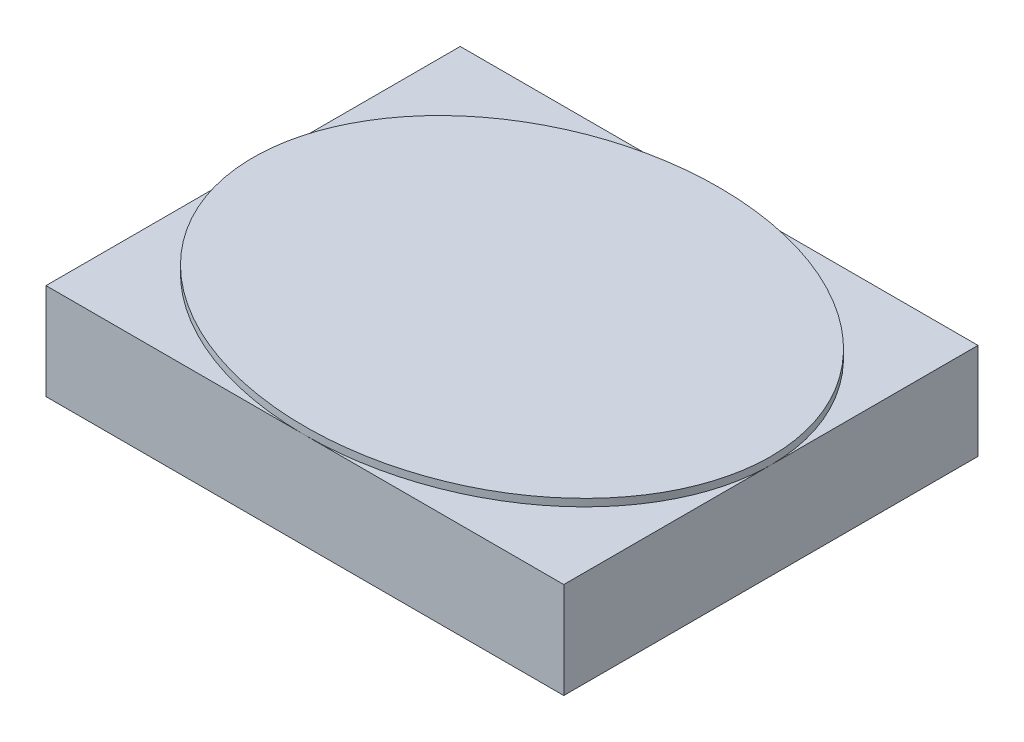
ISO-10303-21;
HEADER;
FILE_DESCRIPTION(('STEP AP214'),'2;1');
FILE_NAME('part.step','',(''),(''),'','','');
FILE_SCHEMA(('AUTOMOTIVE_DESIGN { 1 0 10303 214 1 1 1 1 }'));
ENDSEC;
DATA;
#1=APPLICATION_CONTEXT('core data for automotive mechanical design processes');
#2=APPLICATION_PROTOCOL_DEFINITION('international standard','automotive_design',2000,#1);
#3=PRODUCT_CONTEXT('',#1,'mechanical');
#4=PRODUCT('Part','Part','',(#3));
#5=PRODUCT_RELATED_PRODUCT_CATEGORY('part','',(#4));
#6=PRODUCT_DEFINITION_FORMATION('','',#4);
#7=PRODUCT_DEFINITION_CONTEXT('part definition',#1,'design');
#8=PRODUCT_DEFINITION('design','',#6,#7);
#9=PRODUCT_DEFINITION_SHAPE('','',#8);
#10=(LENGTH_UNIT() NAMED_UNIT(*) SI_UNIT(.MILLI.,.METRE.));
#11=(NAMED_UNIT(*) PLANE_ANGLE_UNIT() SI_UNIT($,.RADIAN.));
#12=(NAMED_UNIT(*) SI_UNIT($,.STERADIAN.) SOLID_ANGLE_UNIT());
#13=UNCERTAINTY_MEASURE_WITH_UNIT(LENGTH_MEASURE(1.E-05),#10,'distance_accuracy_value','');
#14=(GEOMETRIC_REPRESENTATION_CONTEXT(3) GLOBAL_UNCERTAINTY_ASSIGNED_CONTEXT((#13)) GLOBAL_UNIT_ASSIGNED_CONTEXT((#10,
#11,#12)) REPRESENTATION_CONTEXT('',''));
#15=CARTESIAN_POINT('',(0.,0.,0.));
#16=DIRECTION('',(0.,0.,1.));
#17=DIRECTION('',(1.,0.,0.));
#18=AXIS2_PLACEMENT_3D('',#15,#16,#17);
#19=CARTESIAN_POINT('',(0.,0.65,0.));
#20=DIRECTION('',(0.,-1.,0.));
#21=DIRECTION('',(0.,0.,-1.));
#22=AXIS2_PLACEMENT_3D('',#19,#20,#21);
#23=PLANE('',#22);
#24=CARTESIAN_POINT('',(1.75,0.65,-1.4));
#25=DIRECTION('',(0.,1.,0.));
#26=DIRECTION('',(1.,0.,0.));
#27=AXIS2_PLACEMENT_3D('',#24,#25,#26);
#28=ELLIPSE('',#27,1.75,1.4);
#29=CARTESIAN_POINT('',(3.5,0.65,-1.4));
#30=VERTEX_POINT('',#29);
#31=CARTESIAN_POINT('',(1.75,0.65,-2.8));
#32=VERTEX_POINT('',#31);
#33=EDGE_CURVE('E43',#30,#32,#28,.T.);
#34=ORIENTED_EDGE('',*,*,#33,.F.);
#35=DIRECTION('',(0.,0.,-1.));
#36=VECTOR('',#35,1.);
#37=CARTESIAN_POINT('',(3.5,0.65,0.));
#38=LINE('',#37,#36);
#39=CARTESIAN_POINT('',(3.5,0.65,-2.8));
#40=VERTEX_POINT('',#39);
#41=EDGE_CURVE('E93',#30,#40,#38,.T.);
#42=ORIENTED_EDGE('',*,*,#41,.T.);
#43=DIRECTION('',(-1.,0.,0.));
#44=VECTOR('',#43,1.);
#45=CARTESIAN_POINT('',(0.,0.65,-2.8));
#46=LINE('',#45,#44);
#47=EDGE_CURVE('E105',#40,#32,#46,.T.);
#48=ORIENTED_EDGE('',*,*,#47,.T.);
#49=EDGE_LOOP('',(#34,#42,#48));
#50=FACE_BOUND('',#49,.T.);
#51=ADVANCED_FACE('F32',(#50),#23,.F.);
#52=CARTESIAN_POINT('',(0.,0.65,-1.4));
#53=VERTEX_POINT('',#52);
#54=EDGE_CURVE('E11',#32,#53,#28,.T.);
#55=ORIENTED_EDGE('',*,*,#54,.F.);
#56=CARTESIAN_POINT('',(0.,0.65,-2.8));
#57=VERTEX_POINT('',#56);
#58=EDGE_CURVE('E92',#32,#57,#46,.T.);
#59=ORIENTED_EDGE('',*,*,#58,.T.);
#60=DIRECTION('',(0.,0.,1.));
#61=VECTOR('',#60,1.);
#62=CARTESIAN_POINT('',(0.,0.65,0.));
#63=LINE('',#62,#61);
#64=EDGE_CURVE('E115',#57,#53,#63,.T.);
#65=ORIENTED_EDGE('',*,*,#64,.T.);
#66=EDGE_LOOP('',(#55,#59,#65));
#67=FACE_BOUND('',#66,.T.);
#68=ADVANCED_FACE('F146',(#67),#23,.F.);
#69=CARTESIAN_POINT('',(1.75,0.65,0.));
#70=VERTEX_POINT('',#69);
#71=EDGE_CURVE('E41',#53,#70,#28,.T.);
#72=ORIENTED_EDGE('',*,*,#71,.F.);
#73=CARTESIAN_POINT('',(0.,0.65,0.));
#74=VERTEX_POINT('',#73);
#75=EDGE_CURVE('E117',#53,#74,#63,.T.);
#76=ORIENTED_EDGE('',*,*,#75,.T.);
#77=DIRECTION('',(1.,0.,0.));
#78=VECTOR('',#77,1.);
#79=CARTESIAN_POINT('',(0.,0.65,0.));
#80=LINE('',#79,#78);
#81=EDGE_CURVE('E103',#74,#70,#80,.T.);
#82=ORIENTED_EDGE('',*,*,#81,.T.);
#83=EDGE_LOOP('',(#72,#76,#82));
#84=FACE_BOUND('',#83,.T.);
#85=ADVANCED_FACE('F148',(#84),#23,.F.);
#86=CARTESIAN_POINT('',(0.,0.65,0.));
#87=DIRECTION('',(1.,0.,0.));
#88=DIRECTION('',(0.,0.,-1.));
#89=AXIS2_PLACEMENT_3D('',#86,#87,#88);
#90=PLANE('',#89);
#91=DIRECTION('',(0.,0.,1.));
#92=VECTOR('',#91,1.);
#93=CARTESIAN_POINT('',(0.,0.,0.));
#94=LINE('',#93,#92);
#95=CARTESIAN_POINT('',(0.,0.,-2.8));
#96=VERTEX_POINT('',#95);
#97=CARTESIAN_POINT('',(0.,0.,0.));
#98=VERTEX_POINT('',#97);
#99=EDGE_CURVE('E122',#96,#98,#94,.T.);
#100=ORIENTED_EDGE('',*,*,#99,.T.);
#101=DIRECTION('',(0.,-1.,0.));
#102=VECTOR('',#101,1.);
#103=CARTESIAN_POINT('',(0.,0.65,0.));
#104=LINE('',#103,#102);
#105=EDGE_CURVE('E36',#74,#98,#104,.T.);
#106=ORIENTED_EDGE('',*,*,#105,.F.);
#107=ORIENTED_EDGE('',*,*,#75,.F.);
#108=ORIENTED_EDGE('',*,*,#64,.F.);
#109=DIRECTION('',(0.,-1.,0.));
#110=VECTOR('',#109,1.);
#111=CARTESIAN_POINT('',(0.,0.65,-2.8));
#112=LINE('',#111,#110);
#113=EDGE_CURVE('E121',#57,#96,#112,.T.);
#114=ORIENTED_EDGE('',*,*,#113,.T.);
#115=EDGE_LOOP('',(#100,#106,#107,#108,#114));
#116=FACE_BOUND('',#115,.T.);
#117=ADVANCED_FACE('F34',(#116),#90,.F.);
#118=CARTESIAN_POINT('',(0.,0.65,0.));
#119=DIRECTION('',(0.,0.,-1.));
#120=DIRECTION('',(-1.,0.,0.));
#121=AXIS2_PLACEMENT_3D('',#118,#119,#120);
#122=PLANE('',#121);
#123=DIRECTION('',(1.,0.,0.));
#124=VECTOR('',#123,1.);
#125=CARTESIAN_POINT('',(0.,0.,0.));
#126=LINE('',#125,#124);
#127=CARTESIAN_POINT('',(3.5,0.,0.));
#128=VERTEX_POINT('',#127);
#129=EDGE_CURVE('E125',#98,#128,#126,.T.);
#130=ORIENTED_EDGE('',*,*,#129,.T.);
#131=DIRECTION('',(0.,-1.,0.));
#132=VECTOR('',#131,1.);
#133=CARTESIAN_POINT('',(3.5,0.65,0.));
#134=LINE('',#133,#132);
#135=CARTESIAN_POINT('',(3.5,0.65,0.));
#136=VERTEX_POINT('',#135);
#137=EDGE_CURVE('E111',#136,#128,#134,.T.);
#138=ORIENTED_EDGE('',*,*,#137,.F.);
#139=EDGE_CURVE('E88',#70,#136,#80,.T.);
#140=ORIENTED_EDGE('',*,*,#139,.F.);
#141=ORIENTED_EDGE('',*,*,#81,.F.);
#142=ORIENTED_EDGE('',*,*,#105,.T.);
#143=EDGE_LOOP('',(#130,#138,#140,#141,#142));
#144=FACE_BOUND('',#143,.T.);
#145=ADVANCED_FACE('F164',(#144),#122,.F.);
#146=CARTESIAN_POINT('',(3.5,0.65,0.));
#147=DIRECTION('',(-1.,0.,0.));
#148=DIRECTION('',(0.,0.,1.));
#149=AXIS2_PLACEMENT_3D('',#146,#147,#148);
#150=PLANE('',#149);
#151=DIRECTION('',(0.,0.,-1.));
#152=VECTOR('',#151,1.);
#153=CARTESIAN_POINT('',(3.5,0.,0.));
#154=LINE('',#153,#152);
#155=CARTESIAN_POINT('',(3.5,0.,-2.8));
#156=VERTEX_POINT('',#155);
#157=EDGE_CURVE('E127',#128,#156,#154,.T.);
#158=ORIENTED_EDGE('',*,*,#157,.T.);
#159=DIRECTION('',(0.,-1.,0.));
#160=VECTOR('',#159,1.);
#161=CARTESIAN_POINT('',(3.5,0.65,-2.8));
#162=LINE('',#161,#160);
#163=EDGE_CURVE('E99',#40,#156,#162,.T.);
#164=ORIENTED_EDGE('',*,*,#163,.F.);
#165=ORIENTED_EDGE('',*,*,#41,.F.);
#166=EDGE_CURVE('E85',#136,#30,#38,.T.);
#167=ORIENTED_EDGE('',*,*,#166,.F.);
#168=ORIENTED_EDGE('',*,*,#137,.T.);
#169=EDGE_LOOP('',(#158,#164,#165,#167,#168));
#170=FACE_BOUND('',#169,.T.);
#171=ADVANCED_FACE('F97',(#170),#150,.F.);
#172=CARTESIAN_POINT('',(0.,0.65,-2.8));
#173=DIRECTION('',(0.,0.,1.));
#174=DIRECTION('',(1.,0.,0.));
#175=AXIS2_PLACEMENT_3D('',#172,#173,#174);
#176=PLANE('',#175);
#177=DIRECTION('',(-1.,0.,0.));
#178=VECTOR('',#177,1.);
#179=CARTESIAN_POINT('',(0.,0.,-2.8));
#180=LINE('',#179,#178);
#181=EDGE_CURVE('E129',#156,#96,#180,.T.);
#182=ORIENTED_EDGE('',*,*,#181,.T.);
#183=ORIENTED_EDGE('',*,*,#113,.F.);
#184=ORIENTED_EDGE('',*,*,#58,.F.);
#185=ORIENTED_EDGE('',*,*,#47,.F.);
#186=ORIENTED_EDGE('',*,*,#163,.T.);
#187=EDGE_LOOP('',(#182,#183,#184,#185,#186));
#188=FACE_BOUND('',#187,.T.);
#189=ADVANCED_FACE('F141',(#188),#176,.F.);
#190=EDGE_CURVE('E56',#70,#30,#28,.T.);
#191=ORIENTED_EDGE('',*,*,#190,.F.);
#192=ORIENTED_EDGE('',*,*,#139,.T.);
#193=ORIENTED_EDGE('',*,*,#166,.T.);
#194=EDGE_LOOP('',(#191,#192,#193));
#195=FACE_BOUND('',#194,.T.);
#196=ADVANCED_FACE('F87',(#195),#23,.F.);
#197=CARTESIAN_POINT('',(0.,0.,0.));
#198=DIRECTION('',(0.,-1.,0.));
#199=DIRECTION('',(0.,0.,-1.));
#200=AXIS2_PLACEMENT_3D('',#197,#198,#199);
#201=PLANE('',#200);
#202=ORIENTED_EDGE('',*,*,#99,.F.);
#203=ORIENTED_EDGE('',*,*,#181,.F.);
#204=ORIENTED_EDGE('',*,*,#157,.F.);
#205=ORIENTED_EDGE('',*,*,#129,.F.);
#206=EDGE_LOOP('',(#202,#203,#204,#205));
#207=FACE_BOUND('',#206,.T.);
#208=ADVANCED_FACE('F138',(#207),#201,.T.);
#209=CARTESIAN_POINT('',(1.75,0.7,-1.4));
#210=DIRECTION('',(0.,1.,0.));
#211=DIRECTION('',(1.,0.,0.));
#212=AXIS2_PLACEMENT_3D('',#209,#210,#211);
#213=ELLIPSE('',#212,1.75,1.4);
#214=DIRECTION('',(0.,-1.,0.));
#215=VECTOR('',#214,1.);
#216=SURFACE_OF_LINEAR_EXTRUSION('',#213,#215);
#217=CARTESIAN_POINT('',(3.5,0.7,-1.4));
#218=VERTEX_POINT('',#217);
#219=EDGE_CURVE('E107',#218,#218,#213,.T.);
#220=ORIENTED_EDGE('',*,*,#219,.F.);
#221=EDGE_LOOP('',(#220));
#222=FACE_BOUND('',#221,.T.);
#223=ORIENTED_EDGE('',*,*,#33,.T.);
#224=ORIENTED_EDGE('',*,*,#54,.T.);
#225=ORIENTED_EDGE('',*,*,#71,.T.);
#226=ORIENTED_EDGE('',*,*,#190,.T.);
#227=EDGE_LOOP('',(#223,#224,#225,#226));
#228=FACE_BOUND('',#227,.T.);
#229=ADVANCED_FACE('F109',(#222,#228),#216,.F.);
#230=CARTESIAN_POINT('',(1.75,0.7,-1.4));
#231=DIRECTION('',(0.,1.,0.));
#232=DIRECTION('',(0.,0.,1.));
#233=AXIS2_PLACEMENT_3D('',#230,#231,#232);
#234=PLANE('',#233);
#235=ORIENTED_EDGE('',*,*,#219,.T.);
#236=EDGE_LOOP('',(#235));
#237=FACE_BOUND('',#236,.T.);
#238=ADVANCED_FACE('F204',(#237),#234,.T.);
#239=CLOSED_SHELL('',(#51,#68,#85,#117,#145,#171,#189,#196,#208,#229,#238));
#240=MANIFOLD_SOLID_BREP('B2',#239);
#241=ADVANCED_BREP_SHAPE_REPRESENTATION('',(#18,#240),#14);
#242=SHAPE_DEFINITION_REPRESENTATION(#9,#241);
ENDSEC;
END-ISO-10303-21;
